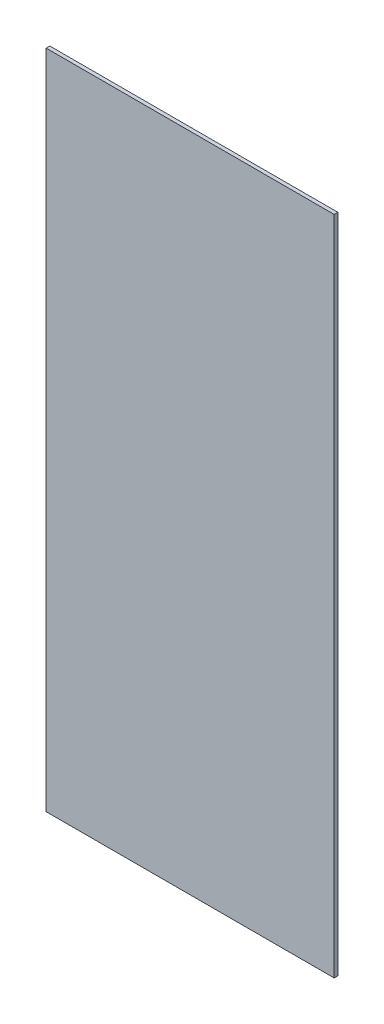
ISO-10303-21;
HEADER;
FILE_DESCRIPTION(('STEP AP214'),'2;1');
FILE_NAME('part.step','',(''),(''),'','','');
FILE_SCHEMA(('AUTOMOTIVE_DESIGN { 1 0 10303 214 1 1 1 1 }'));
ENDSEC;
DATA;
#1=APPLICATION_CONTEXT('core data for automotive mechanical design processes');
#2=APPLICATION_PROTOCOL_DEFINITION('international standard','automotive_design',2000,#1);
#3=PRODUCT_CONTEXT('',#1,'mechanical');
#4=PRODUCT('Part','Part','',(#3));
#5=PRODUCT_RELATED_PRODUCT_CATEGORY('part','',(#4));
#6=PRODUCT_DEFINITION_FORMATION('','',#4);
#7=PRODUCT_DEFINITION_CONTEXT('part definition',#1,'design');
#8=PRODUCT_DEFINITION('design','',#6,#7);
#9=PRODUCT_DEFINITION_SHAPE('','',#8);
#10=(LENGTH_UNIT() NAMED_UNIT(*) SI_UNIT(.MILLI.,.METRE.));
#11=(NAMED_UNIT(*) PLANE_ANGLE_UNIT() SI_UNIT($,.RADIAN.));
#12=(NAMED_UNIT(*) SI_UNIT($,.STERADIAN.) SOLID_ANGLE_UNIT());
#13=UNCERTAINTY_MEASURE_WITH_UNIT(LENGTH_MEASURE(1.E-05),#10,'distance_accuracy_value','');
#14=(GEOMETRIC_REPRESENTATION_CONTEXT(3) GLOBAL_UNCERTAINTY_ASSIGNED_CONTEXT((#13)) GLOBAL_UNIT_ASSIGNED_CONTEXT((#10,
#11,#12)) REPRESENTATION_CONTEXT('',''));
#15=CARTESIAN_POINT('',(0.,0.,0.));
#16=DIRECTION('',(0.,0.,1.));
#17=DIRECTION('',(1.,0.,0.));
#18=AXIS2_PLACEMENT_3D('',#15,#16,#17);
#19=CARTESIAN_POINT('',(0.,0.,3.175));
#20=DIRECTION('',(1.,0.,0.));
#21=DIRECTION('',(0.,0.,-1.));
#22=AXIS2_PLACEMENT_3D('',#19,#20,#21);
#23=PLANE('',#22);
#24=DIRECTION('',(0.,-1.,0.));
#25=VECTOR('',#24,1.);
#26=CARTESIAN_POINT('',(0.,0.,0.));
#27=LINE('',#26,#25);
#28=CARTESIAN_POINT('',(0.,571.5,0.));
#29=VERTEX_POINT('',#28);
#30=CARTESIAN_POINT('',(0.,0.,0.));
#31=VERTEX_POINT('',#30);
#32=EDGE_CURVE('E103',#29,#31,#27,.T.);
#33=ORIENTED_EDGE('',*,*,#32,.T.);
#34=DIRECTION('',(0.,0.,-1.));
#35=VECTOR('',#34,1.);
#36=CARTESIAN_POINT('',(0.,0.,3.175));
#37=LINE('',#36,#35);
#38=CARTESIAN_POINT('',(0.,0.,3.175));
#39=VERTEX_POINT('',#38);
#40=EDGE_CURVE('E11',#39,#31,#37,.T.);
#41=ORIENTED_EDGE('',*,*,#40,.F.);
#42=DIRECTION('',(0.,-1.,0.));
#43=VECTOR('',#42,1.);
#44=CARTESIAN_POINT('',(0.,0.,3.175));
#45=LINE('',#44,#43);
#46=CARTESIAN_POINT('',(0.,571.5,3.175));
#47=VERTEX_POINT('',#46);
#48=EDGE_CURVE('E91',#47,#39,#45,.T.);
#49=ORIENTED_EDGE('',*,*,#48,.F.);
#50=DIRECTION('',(0.,0.,-1.));
#51=VECTOR('',#50,1.);
#52=CARTESIAN_POINT('',(0.,571.5,3.175));
#53=LINE('',#52,#51);
#54=EDGE_CURVE('E99',#47,#29,#53,.T.);
#55=ORIENTED_EDGE('',*,*,#54,.T.);
#56=EDGE_LOOP('',(#33,#41,#49,#55));
#57=FACE_BOUND('',#56,.T.);
#58=ADVANCED_FACE('F40',(#57),#23,.F.);
#59=CARTESIAN_POINT('',(0.,0.,3.175));
#60=DIRECTION('',(0.,1.,0.));
#61=DIRECTION('',(0.,0.,1.));
#62=AXIS2_PLACEMENT_3D('',#59,#60,#61);
#63=PLANE('',#62);
#64=DIRECTION('',(1.,0.,0.));
#65=VECTOR('',#64,1.);
#66=CARTESIAN_POINT('',(0.,0.,0.));
#67=LINE('',#66,#65);
#68=CARTESIAN_POINT('',(248.92,0.,0.));
#69=VERTEX_POINT('',#68);
#70=EDGE_CURVE('E95',#31,#69,#67,.T.);
#71=ORIENTED_EDGE('',*,*,#70,.T.);
#72=DIRECTION('',(0.,0.,-1.));
#73=VECTOR('',#72,1.);
#74=CARTESIAN_POINT('',(248.92,0.,3.175));
#75=LINE('',#74,#73);
#76=CARTESIAN_POINT('',(248.92,0.,3.175));
#77=VERTEX_POINT('',#76);
#78=EDGE_CURVE('E48',#77,#69,#75,.T.);
#79=ORIENTED_EDGE('',*,*,#78,.F.);
#80=DIRECTION('',(1.,0.,0.));
#81=VECTOR('',#80,1.);
#82=CARTESIAN_POINT('',(0.,0.,3.175));
#83=LINE('',#82,#81);
#84=EDGE_CURVE('E86',#39,#77,#83,.T.);
#85=ORIENTED_EDGE('',*,*,#84,.F.);
#86=ORIENTED_EDGE('',*,*,#40,.T.);
#87=EDGE_LOOP('',(#71,#79,#85,#86));
#88=FACE_BOUND('',#87,.T.);
#89=ADVANCED_FACE('F94',(#88),#63,.F.);
#90=CARTESIAN_POINT('',(248.92,0.,3.175));
#91=DIRECTION('',(-1.,0.,0.));
#92=DIRECTION('',(0.,0.,1.));
#93=AXIS2_PLACEMENT_3D('',#90,#91,#92);
#94=PLANE('',#93);
#95=DIRECTION('',(0.,1.,0.));
#96=VECTOR('',#95,1.);
#97=CARTESIAN_POINT('',(248.92,0.,0.));
#98=LINE('',#97,#96);
#99=CARTESIAN_POINT('',(248.92,571.5,0.));
#100=VERTEX_POINT('',#99);
#101=EDGE_CURVE('E73',#69,#100,#98,.T.);
#102=ORIENTED_EDGE('',*,*,#101,.T.);
#103=DIRECTION('',(0.,0.,-1.));
#104=VECTOR('',#103,1.);
#105=CARTESIAN_POINT('',(248.92,571.5,3.175));
#106=LINE('',#105,#104);
#107=CARTESIAN_POINT('',(248.92,571.5,3.175));
#108=VERTEX_POINT('',#107);
#109=EDGE_CURVE('E96',#108,#100,#106,.T.);
#110=ORIENTED_EDGE('',*,*,#109,.F.);
#111=DIRECTION('',(0.,1.,0.));
#112=VECTOR('',#111,1.);
#113=CARTESIAN_POINT('',(248.92,0.,3.175));
#114=LINE('',#113,#112);
#115=EDGE_CURVE('E89',#77,#108,#114,.T.);
#116=ORIENTED_EDGE('',*,*,#115,.F.);
#117=ORIENTED_EDGE('',*,*,#78,.T.);
#118=EDGE_LOOP('',(#102,#110,#116,#117));
#119=FACE_BOUND('',#118,.T.);
#120=ADVANCED_FACE('F97',(#119),#94,.F.);
#121=CARTESIAN_POINT('',(0.,571.5,3.175));
#122=DIRECTION('',(0.,-1.,0.));
#123=DIRECTION('',(0.,0.,-1.));
#124=AXIS2_PLACEMENT_3D('',#121,#122,#123);
#125=PLANE('',#124);
#126=DIRECTION('',(-1.,0.,0.));
#127=VECTOR('',#126,1.);
#128=CARTESIAN_POINT('',(0.,571.5,0.));
#129=LINE('',#128,#127);
#130=EDGE_CURVE('E79',#100,#29,#129,.T.);
#131=ORIENTED_EDGE('',*,*,#130,.T.);
#132=ORIENTED_EDGE('',*,*,#54,.F.);
#133=DIRECTION('',(-1.,0.,0.));
#134=VECTOR('',#133,1.);
#135=CARTESIAN_POINT('',(0.,571.5,3.175));
#136=LINE('',#135,#134);
#137=EDGE_CURVE('E56',#108,#47,#136,.T.);
#138=ORIENTED_EDGE('',*,*,#137,.F.);
#139=ORIENTED_EDGE('',*,*,#109,.T.);
#140=EDGE_LOOP('',(#131,#132,#138,#139));
#141=FACE_BOUND('',#140,.T.);
#142=ADVANCED_FACE('F110',(#141),#125,.F.);
#143=CARTESIAN_POINT('',(0.,0.,3.175));
#144=DIRECTION('',(0.,0.,-1.));
#145=DIRECTION('',(-1.,0.,0.));
#146=AXIS2_PLACEMENT_3D('',#143,#144,#145);
#147=PLANE('',#146);
#148=ORIENTED_EDGE('',*,*,#48,.T.);
#149=ORIENTED_EDGE('',*,*,#84,.T.);
#150=ORIENTED_EDGE('',*,*,#115,.T.);
#151=ORIENTED_EDGE('',*,*,#137,.T.);
#152=EDGE_LOOP('',(#148,#149,#150,#151));
#153=FACE_BOUND('',#152,.T.);
#154=ADVANCED_FACE('F87',(#153),#147,.F.);
#155=CARTESIAN_POINT('',(0.,0.,0.));
#156=DIRECTION('',(0.,0.,-1.));
#157=DIRECTION('',(-1.,0.,0.));
#158=AXIS2_PLACEMENT_3D('',#155,#156,#157);
#159=PLANE('',#158);
#160=ORIENTED_EDGE('',*,*,#32,.F.);
#161=ORIENTED_EDGE('',*,*,#130,.F.);
#162=ORIENTED_EDGE('',*,*,#101,.F.);
#163=ORIENTED_EDGE('',*,*,#70,.F.);
#164=EDGE_LOOP('',(#160,#161,#162,#163));
#165=FACE_BOUND('',#164,.T.);
#166=ADVANCED_FACE('F113',(#165),#159,.T.);
#167=CLOSED_SHELL('',(#58,#89,#120,#142,#154,#166));
#168=MANIFOLD_SOLID_BREP('B2',#167);
#169=ADVANCED_BREP_SHAPE_REPRESENTATION('',(#18,#168),#14);
#170=SHAPE_DEFINITION_REPRESENTATION(#9,#169);
ENDSEC;
END-ISO-10303-21;
